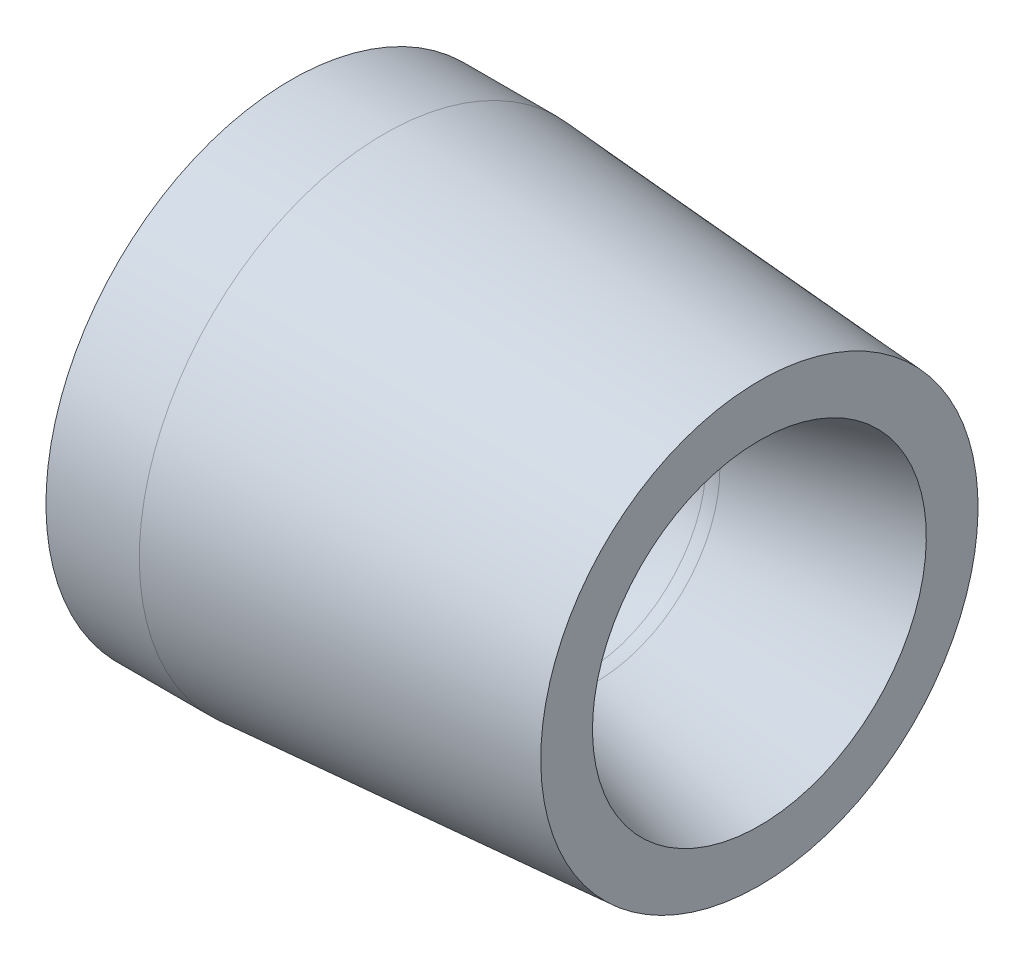
ISO-10303-21;
HEADER;
FILE_DESCRIPTION(('STEP AP214'),'2;1');
FILE_NAME('part.step','',(''),(''),'','','');
FILE_SCHEMA(('AUTOMOTIVE_DESIGN { 1 0 10303 214 1 1 1 1 }'));
ENDSEC;
DATA;
#1=APPLICATION_CONTEXT('core data for automotive mechanical design processes');
#2=APPLICATION_PROTOCOL_DEFINITION('international standard','automotive_design',2000,#1);
#3=PRODUCT_CONTEXT('',#1,'mechanical');
#4=PRODUCT('Part','Part','',(#3));
#5=PRODUCT_RELATED_PRODUCT_CATEGORY('part','',(#4));
#6=PRODUCT_DEFINITION_FORMATION('','',#4);
#7=PRODUCT_DEFINITION_CONTEXT('part definition',#1,'design');
#8=PRODUCT_DEFINITION('design','',#6,#7);
#9=PRODUCT_DEFINITION_SHAPE('','',#8);
#10=(LENGTH_UNIT() NAMED_UNIT(*) SI_UNIT(.MILLI.,.METRE.));
#11=(NAMED_UNIT(*) PLANE_ANGLE_UNIT() SI_UNIT($,.RADIAN.));
#12=(NAMED_UNIT(*) SI_UNIT($,.STERADIAN.) SOLID_ANGLE_UNIT());
#13=UNCERTAINTY_MEASURE_WITH_UNIT(LENGTH_MEASURE(1.E-05),#10,'distance_accuracy_value','');
#14=(GEOMETRIC_REPRESENTATION_CONTEXT(3) GLOBAL_UNCERTAINTY_ASSIGNED_CONTEXT((#13)) GLOBAL_UNIT_ASSIGNED_CONTEXT((#10,
#11,#12)) REPRESENTATION_CONTEXT('',''));
#15=CARTESIAN_POINT('',(0.,0.,0.));
#16=DIRECTION('',(0.,0.,1.));
#17=DIRECTION('',(1.,0.,0.));
#18=AXIS2_PLACEMENT_3D('',#15,#16,#17);
#19=CARTESIAN_POINT('',(1.78084856857237,0.,0.));
#20=DIRECTION('',(1.,0.,0.));
#21=DIRECTION('',(0.,1.,0.));
#22=AXIS2_PLACEMENT_3D('',#19,#20,#21);
#23=CONICAL_SURFACE('',#22,17.8882556763971,0.262685253079923);
#24=CARTESIAN_POINT('',(1.78084856857237,0.,0.));
#25=DIRECTION('',(1.,0.,0.));
#26=DIRECTION('',(0.,1.,0.));
#27=AXIS2_PLACEMENT_3D('',#24,#25,#26);
#28=CIRCLE('',#27,17.8882556763971);
#29=CARTESIAN_POINT('',(1.78084856857237,17.8882556763971,0.));
#30=VERTEX_POINT('',#29);
#31=EDGE_CURVE('E50',#30,#30,#28,.T.);
#32=ORIENTED_EDGE('',*,*,#31,.F.);
#33=EDGE_LOOP('',(#32));
#34=FACE_BOUND('',#33,.T.);
#35=CARTESIAN_POINT('',(25.4,0.,0.));
#36=DIRECTION('',(1.,0.,0.));
#37=DIRECTION('',(0.,1.,0.));
#38=AXIS2_PLACEMENT_3D('',#35,#36,#37);
#39=CIRCLE('',#38,24.2394191763448);
#40=CARTESIAN_POINT('',(25.4,24.2394191763448,0.));
#41=VERTEX_POINT('',#40);
#42=EDGE_CURVE('E45',#41,#41,#39,.T.);
#43=ORIENTED_EDGE('',*,*,#42,.T.);
#44=EDGE_LOOP('',(#43));
#45=FACE_BOUND('',#44,.T.);
#46=ADVANCED_FACE('F41',(#34,#45),#23,.F.);
#47=CARTESIAN_POINT('',(-59.69,0.,0.));
#48=DIRECTION('',(-1.,0.,0.));
#49=DIRECTION('',(0.,-1.,0.));
#50=AXIS2_PLACEMENT_3D('',#47,#48,#49);
#51=CONICAL_SURFACE('',#50,38.1,0.356624235626495);
#52=CARTESIAN_POINT('',(-9.31084010694146,0.,0.));
#53=DIRECTION('',(1.,0.,0.));
#54=DIRECTION('',(0.,1.,0.));
#55=AXIS2_PLACEMENT_3D('',#52,#53,#54);
#56=CIRCLE('',#55,19.3310581686222);
#57=CARTESIAN_POINT('',(-9.31084010694146,19.3310581686222,0.));
#58=VERTEX_POINT('',#57);
#59=EDGE_CURVE('E55',#58,#58,#56,.T.);
#60=ORIENTED_EDGE('',*,*,#59,.T.);
#61=EDGE_LOOP('',(#60));
#62=FACE_BOUND('',#61,.T.);
#63=CARTESIAN_POINT('',(-42.6454767554289,0.,0.));
#64=DIRECTION('',(-1.,0.,0.));
#65=DIRECTION('',(0.,-1.,0.));
#66=AXIS2_PLACEMENT_3D('',#63,#64,#65);
#67=CIRCLE('',#66,31.75);
#68=CARTESIAN_POINT('',(-42.6454767554289,-31.75,0.));
#69=VERTEX_POINT('',#68);
#70=EDGE_CURVE('E61',#69,#69,#67,.T.);
#71=ORIENTED_EDGE('',*,*,#70,.T.);
#72=EDGE_LOOP('',(#71));
#73=FACE_BOUND('',#72,.T.);
#74=ADVANCED_FACE('F92',(#62,#73),#51,.F.);
#75=CARTESIAN_POINT('',(0.,0.,0.));
#76=DIRECTION('',(1.,0.,0.));
#77=DIRECTION('',(0.,1.,0.));
#78=AXIS2_PLACEMENT_3D('',#75,#76,#77);
#79=TOROIDAL_SURFACE('',#78,44.323,26.67);
#80=CARTESIAN_POINT('',(0.,0.,0.));
#81=DIRECTION('',(1.,0.,0.));
#82=DIRECTION('',(0.,1.,0.));
#83=AXIS2_PLACEMENT_3D('',#80,#81,#82);
#84=CIRCLE('',#83,17.653);
#85=CARTESIAN_POINT('',(0.,17.653,0.));
#86=VERTEX_POINT('',#85);
#87=EDGE_CURVE('E10',#86,#86,#84,.T.);
#88=ORIENTED_EDGE('',*,*,#87,.T.);
#89=EDGE_LOOP('',(#88));
#90=FACE_BOUND('',#89,.T.);
#91=ORIENTED_EDGE('',*,*,#59,.F.);
#92=EDGE_LOOP('',(#91));
#93=FACE_BOUND('',#92,.T.);
#94=ADVANCED_FACE('F43',(#90,#93),#79,.T.);
#95=CARTESIAN_POINT('',(0.,0.,0.));
#96=DIRECTION('',(1.,0.,0.));
#97=DIRECTION('',(0.,1.,0.));
#98=AXIS2_PLACEMENT_3D('',#95,#96,#97);
#99=TOROIDAL_SURFACE('',#98,24.511,6.858);
#100=ORIENTED_EDGE('',*,*,#31,.T.);
#101=EDGE_LOOP('',(#100));
#102=FACE_BOUND('',#101,.T.);
#103=ORIENTED_EDGE('',*,*,#87,.F.);
#104=EDGE_LOOP('',(#103));
#105=FACE_BOUND('',#104,.T.);
#106=ADVANCED_FACE('F103',(#102,#105),#99,.T.);
#107=CARTESIAN_POINT('',(-42.6454767554289,0.,0.));
#108=DIRECTION('',(-1.,0.,0.));
#109=DIRECTION('',(0.,-1.,0.));
#110=AXIS2_PLACEMENT_3D('',#107,#108,#109);
#111=PLANE('',#110);
#112=CARTESIAN_POINT('',(-42.6454767554289,0.,0.));
#113=DIRECTION('',(-1.,0.,0.));
#114=DIRECTION('',(0.,-1.,0.));
#115=AXIS2_PLACEMENT_3D('',#112,#113,#114);
#116=CIRCLE('',#115,35.56);
#117=CARTESIAN_POINT('',(-42.6454767554289,-35.56,0.));
#118=VERTEX_POINT('',#117);
#119=EDGE_CURVE('E65',#118,#118,#116,.T.);
#120=ORIENTED_EDGE('',*,*,#119,.T.);
#121=EDGE_LOOP('',(#120));
#122=FACE_BOUND('',#121,.T.);
#123=ORIENTED_EDGE('',*,*,#70,.F.);
#124=EDGE_LOOP('',(#123));
#125=FACE_BOUND('',#124,.T.);
#126=ADVANCED_FACE('F105',(#122,#125),#111,.T.);
#127=CARTESIAN_POINT('',(-50.8,0.,0.));
#128=DIRECTION('',(-1.,0.,0.));
#129=DIRECTION('',(0.,-1.,0.));
#130=AXIS2_PLACEMENT_3D('',#127,#128,#129);
#131=CYLINDRICAL_SURFACE('',#130,35.56);
#132=ORIENTED_EDGE('',*,*,#119,.F.);
#133=EDGE_LOOP('',(#132));
#134=FACE_BOUND('',#133,.T.);
#135=CARTESIAN_POINT('',(-29.085538438072,0.,0.));
#136=DIRECTION('',(-1.,0.,0.));
#137=DIRECTION('',(0.,-1.,0.));
#138=AXIS2_PLACEMENT_3D('',#135,#136,#137);
#139=CIRCLE('',#138,35.56);
#140=CARTESIAN_POINT('',(-29.085538438072,-35.56,0.));
#141=VERTEX_POINT('',#140);
#142=EDGE_CURVE('E69',#141,#141,#139,.T.);
#143=ORIENTED_EDGE('',*,*,#142,.T.);
#144=EDGE_LOOP('',(#143));
#145=FACE_BOUND('',#144,.T.);
#146=ADVANCED_FACE('F88',(#134,#145),#131,.T.);
#147=CARTESIAN_POINT('',(-29.085538438072,0.,0.));
#148=DIRECTION('',(-1.,0.,0.));
#149=DIRECTION('',(0.,-1.,0.));
#150=AXIS2_PLACEMENT_3D('',#147,#148,#149);
#151=CONICAL_SURFACE('',#150,35.56,0.0698131700797735);
#152=CARTESIAN_POINT('',(25.4,0.,0.));
#153=DIRECTION('',(-1.,0.,0.));
#154=DIRECTION('',(0.,-1.,0.));
#155=AXIS2_PLACEMENT_3D('',#152,#153,#154);
#156=CIRCLE('',#155,31.75);
#157=CARTESIAN_POINT('',(25.4,-31.75,0.));
#158=VERTEX_POINT('',#157);
#159=EDGE_CURVE('E73',#158,#158,#156,.T.);
#160=ORIENTED_EDGE('',*,*,#159,.T.);
#161=EDGE_LOOP('',(#160));
#162=FACE_BOUND('',#161,.T.);
#163=ORIENTED_EDGE('',*,*,#142,.F.);
#164=EDGE_LOOP('',(#163));
#165=FACE_BOUND('',#164,.T.);
#166=ADVANCED_FACE('F78',(#162,#165),#151,.T.);
#167=CARTESIAN_POINT('',(25.4,0.,0.));
#168=DIRECTION('',(1.,0.,0.));
#169=DIRECTION('',(0.,1.,0.));
#170=AXIS2_PLACEMENT_3D('',#167,#168,#169);
#171=PLANE('',#170);
#172=ORIENTED_EDGE('',*,*,#42,.F.);
#173=EDGE_LOOP('',(#172));
#174=FACE_BOUND('',#173,.T.);
#175=ORIENTED_EDGE('',*,*,#159,.F.);
#176=EDGE_LOOP('',(#175));
#177=FACE_BOUND('',#176,.T.);
#178=ADVANCED_FACE('F81',(#174,#177),#171,.T.);
#179=CLOSED_SHELL('',(#46,#74,#94,#106,#126,#146,#166,#178));
#180=MANIFOLD_SOLID_BREP('B2',#179);
#181=ADVANCED_BREP_SHAPE_REPRESENTATION('',(#18,#180),#14);
#182=SHAPE_DEFINITION_REPRESENTATION(#9,#181);
ENDSEC;
END-ISO-10303-21;
